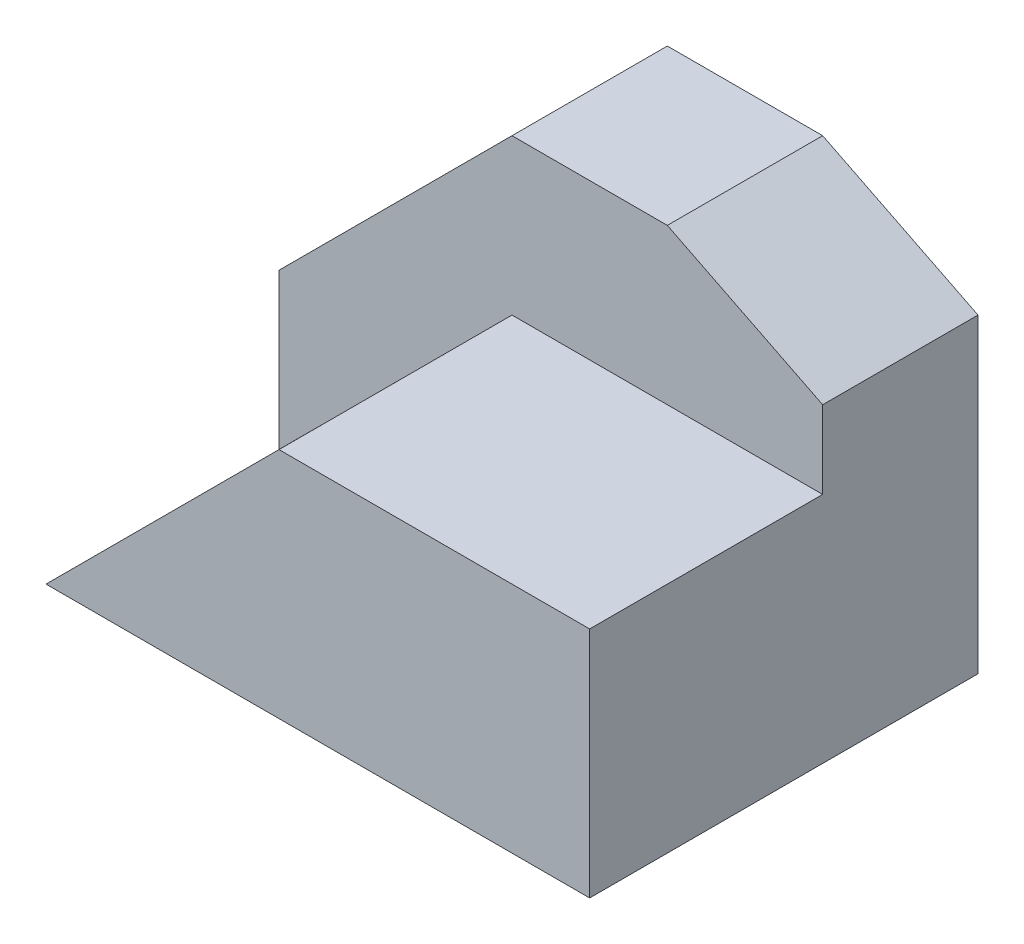
ISO-10303-21;
HEADER;
FILE_DESCRIPTION(('STEP AP214'),'2;1');
FILE_NAME('part.step','',(''),(''),'','','');
FILE_SCHEMA(('AUTOMOTIVE_DESIGN { 1 0 10303 214 1 1 1 1 }'));
ENDSEC;
DATA;
#1=APPLICATION_CONTEXT('core data for automotive mechanical design processes');
#2=APPLICATION_PROTOCOL_DEFINITION('international standard','automotive_design',2000,#1);
#3=PRODUCT_CONTEXT('',#1,'mechanical');
#4=PRODUCT('Part','Part','',(#3));
#5=PRODUCT_RELATED_PRODUCT_CATEGORY('part','',(#4));
#6=PRODUCT_DEFINITION_FORMATION('','',#4);
#7=PRODUCT_DEFINITION_CONTEXT('part definition',#1,'design');
#8=PRODUCT_DEFINITION('design','',#6,#7);
#9=PRODUCT_DEFINITION_SHAPE('','',#8);
#10=(LENGTH_UNIT() NAMED_UNIT(*) SI_UNIT(.MILLI.,.METRE.));
#11=(NAMED_UNIT(*) PLANE_ANGLE_UNIT() SI_UNIT($,.RADIAN.));
#12=(NAMED_UNIT(*) SI_UNIT($,.STERADIAN.) SOLID_ANGLE_UNIT());
#13=UNCERTAINTY_MEASURE_WITH_UNIT(LENGTH_MEASURE(1.E-05),#10,'distance_accuracy_value','');
#14=(GEOMETRIC_REPRESENTATION_CONTEXT(3) GLOBAL_UNCERTAINTY_ASSIGNED_CONTEXT((#13)) GLOBAL_UNIT_ASSIGNED_CONTEXT((#10,
#11,#12)) REPRESENTATION_CONTEXT('',''));
#15=CARTESIAN_POINT('',(0.,0.,0.));
#16=DIRECTION('',(0.,0.,1.));
#17=DIRECTION('',(1.,0.,0.));
#18=AXIS2_PLACEMENT_3D('',#15,#16,#17);
#19=CARTESIAN_POINT('',(-1.5,1.5,2.));
#20=DIRECTION('',(-0.707106781186547,0.707106781186547,0.));
#21=DIRECTION('',(-0.707106781186548,-0.707106781186548,0.));
#22=AXIS2_PLACEMENT_3D('',#19,#20,#21);
#23=PLANE('',#22);
#24=DIRECTION('',(0.707106781186548,0.707106781186548,0.));
#25=VECTOR('',#24,1.);
#26=CARTESIAN_POINT('',(-1.5,1.5,0.));
#27=LINE('',#26,#25);
#28=CARTESIAN_POINT('',(-3.5,-0.500000000000001,0.));
#29=VERTEX_POINT('',#28);
#30=CARTESIAN_POINT('',(-0.5,2.5,0.));
#31=VERTEX_POINT('',#30);
#32=EDGE_CURVE('E153',#29,#31,#27,.T.);
#33=ORIENTED_EDGE('',*,*,#32,.F.);
#34=DIRECTION('',(0.,0.,-1.));
#35=VECTOR('',#34,1.);
#36=CARTESIAN_POINT('',(-3.5,-0.500000000000001,2.));
#37=LINE('',#36,#35);
#38=CARTESIAN_POINT('',(-3.5,-0.500000000000001,2.));
#39=VERTEX_POINT('',#38);
#40=EDGE_CURVE('E11',#39,#29,#37,.T.);
#41=ORIENTED_EDGE('',*,*,#40,.F.);
#42=DIRECTION('',(0.707106781186548,0.707106781186548,0.));
#43=VECTOR('',#42,1.);
#44=CARTESIAN_POINT('',(-1.5,1.5,2.));
#45=LINE('',#44,#43);
#46=CARTESIAN_POINT('',(-0.5,2.5,2.));
#47=VERTEX_POINT('',#46);
#48=EDGE_CURVE('E169',#39,#47,#45,.T.);
#49=ORIENTED_EDGE('',*,*,#48,.T.);
#50=DIRECTION('',(0.,0.,-1.));
#51=VECTOR('',#50,1.);
#52=CARTESIAN_POINT('',(-0.5,2.5,2.));
#53=LINE('',#52,#51);
#54=EDGE_CURVE('E290',#47,#31,#53,.T.);
#55=ORIENTED_EDGE('',*,*,#54,.T.);
#56=EDGE_LOOP('',(#33,#41,#49,#55));
#57=FACE_BOUND('',#56,.T.);
#58=ADVANCED_FACE('F34',(#57),#23,.T.);
#59=CARTESIAN_POINT('',(-3.5,0.,2.));
#60=DIRECTION('',(-1.,0.,0.));
#61=DIRECTION('',(0.,0.,1.));
#62=AXIS2_PLACEMENT_3D('',#59,#60,#61);
#63=PLANE('',#62);
#64=DIRECTION('',(0.,1.,0.));
#65=VECTOR('',#64,1.);
#66=CARTESIAN_POINT('',(-3.5,0.,0.));
#67=LINE('',#66,#65);
#68=CARTESIAN_POINT('',(-3.5,-2.5,0.));
#69=VERTEX_POINT('',#68);
#70=EDGE_CURVE('E293',#69,#29,#67,.T.);
#71=ORIENTED_EDGE('',*,*,#70,.F.);
#72=DIRECTION('',(0.,0.,-1.));
#73=VECTOR('',#72,1.);
#74=CARTESIAN_POINT('',(-3.5,-2.5,2.));
#75=LINE('',#74,#73);
#76=CARTESIAN_POINT('',(-3.49995989733603,-2.50006015399596,1.99997994866801));
#77=VERTEX_POINT('',#76);
#78=EDGE_CURVE('E44',#77,#69,#75,.T.);
#79=ORIENTED_EDGE('',*,*,#78,.F.);
#80=DIRECTION('',(0.,1.,0.));
#81=VECTOR('',#80,1.);
#82=CARTESIAN_POINT('',(-3.5,0.,2.));
#83=LINE('',#82,#81);
#84=EDGE_CURVE('E165',#77,#39,#83,.T.);
#85=ORIENTED_EDGE('',*,*,#84,.T.);
#86=ORIENTED_EDGE('',*,*,#40,.T.);
#87=EDGE_LOOP('',(#71,#79,#85,#86));
#88=FACE_BOUND('',#87,.T.);
#89=ADVANCED_FACE('F207',(#88),#63,.T.);
#90=CARTESIAN_POINT('',(0.,-2.5,2.));
#91=DIRECTION('',(0.,1.,0.));
#92=DIRECTION('',(0.,0.,1.));
#93=AXIS2_PLACEMENT_3D('',#90,#91,#92);
#94=PLANE('',#93);
#95=DIRECTION('',(1.,0.,0.));
#96=VECTOR('',#95,1.);
#97=CARTESIAN_POINT('',(0.,-2.5,0.));
#98=LINE('',#97,#96);
#99=CARTESIAN_POINT('',(3.5,-2.5,0.));
#100=VERTEX_POINT('',#99);
#101=EDGE_CURVE('E296',#69,#100,#98,.T.);
#102=ORIENTED_EDGE('',*,*,#101,.T.);
#103=DIRECTION('',(0.,0.,-1.));
#104=VECTOR('',#103,1.);
#105=CARTESIAN_POINT('',(3.5,-2.5,2.));
#106=LINE('',#105,#104);
#107=CARTESIAN_POINT('',(3.5,-2.5,5.));
#108=VERTEX_POINT('',#107);
#109=EDGE_CURVE('E162',#108,#100,#106,.T.);
#110=ORIENTED_EDGE('',*,*,#109,.F.);
#111=DIRECTION('',(1.,0.,0.));
#112=VECTOR('',#111,1.);
#113=CARTESIAN_POINT('',(3.5,-2.5,5.));
#114=LINE('',#113,#112);
#115=CARTESIAN_POINT('',(-3.49998791664692,-2.49998791664692,5.));
#116=VERTEX_POINT('',#115);
#117=EDGE_CURVE('E138',#116,#108,#114,.T.);
#118=ORIENTED_EDGE('',*,*,#117,.F.);
#119=CARTESIAN_POINT('',(-3.5,-2.5,2.08810896009386));
#120=CARTESIAN_POINT('',(-3.50007851444074,-2.49988222833889,2.20945053676361));
#121=CARTESIAN_POINT('',(-3.50009156756741,-2.49986264864889,2.33079210595433));
#122=CARTESIAN_POINT('',(-3.50006176893456,-2.49990734659817,2.57344729401244));
#123=CARTESIAN_POINT('',(-3.50001893005005,-2.49997160492493,2.69476091288065));
#124=CARTESIAN_POINT('',(-3.49995233096186,-2.50007150355722,2.93739268453878));
#125=CARTESIAN_POINT('',(-3.49992857147004,-2.50010714279494,3.05871083732899));
#126=CARTESIAN_POINT('',(-3.49991500820322,-2.50012748769517,3.3013617028276));
#127=CARTESIAN_POINT('',(-3.49992520850089,-2.50011218724867,3.42269441553721));
#128=CARTESIAN_POINT('',(-3.49996535213893,-2.5000519717916,3.66536847555977));
#129=CARTESIAN_POINT('',(-3.49999529688699,-2.50000705466951,3.78670982287152));
#130=CARTESIAN_POINT('',(-3.50004596538102,-2.49993105192848,4.02938812207761));
#131=CARTESIAN_POINT('',(-3.50006668946182,-2.49989996580727,4.15072507397154));
#132=CARTESIAN_POINT('',(-3.50007245542719,-2.49989131685921,4.39338611810022));
#133=CARTESIAN_POINT('',(-3.5000575010935,-2.49991374835975,4.51471021033489));
#134=CARTESIAN_POINT('',(-3.50002522795389,-2.49996215806915,4.7573572124985));
#135=CARTESIAN_POINT('',(-3.500007909171,-2.49998813624348,4.87868012242745));
#136=CARTESIAN_POINT('',(-3.50000606245871,-2.4999909063119,5.00000303122936));
#137=B_SPLINE_CURVE_WITH_KNOTS('',3,(#119,#120,#121,#122,#123,#124,#125,#126,#127,#128,#129,
#130,#131,#132,#133,#134,#135,#136),.UNSPECIFIED.,.F.,.F.,(4,2,2,2,2,2,2,2,4),(0.,
0.364024739493984,0.727965638781843,1.09192011652536,1.45591824365735,1.81994232498666,
2.18395318616919,2.54792546563386,2.91189420019293),.UNSPECIFIED.);
#138=CARTESIAN_POINT('',(-3.5,-2.5,2.08810896009386));
#139=VERTEX_POINT('',#138);
#140=EDGE_CURVE('E151',#116,#139,#137,.F.);
#141=ORIENTED_EDGE('',*,*,#140,.T.);
#142=CARTESIAN_POINT('',(-3.49991979467205,-2.50012030799193,1.99995989733602));
#143=CARTESIAN_POINT('',(-3.49992385034678,-2.50011422447984,2.00363308435692));
#144=CARTESIAN_POINT('',(-3.49992781097316,-2.50010828354026,2.00730627171809));
#145=CARTESIAN_POINT('',(-3.49993554646942,-2.50009668029587,2.01465255356451));
#146=CARTESIAN_POINT('',(-3.49993932134402,-2.50009101798398,2.01832564804976));
#147=CARTESIAN_POINT('',(-3.49994668979138,-2.50007996531293,2.02567174636572));
#148=CARTESIAN_POINT('',(-3.49995028336865,-2.50007457494703,2.02934475019642));
#149=CARTESIAN_POINT('',(-3.4999572936106,-2.5000640595841,2.03669066939945));
#150=CARTESIAN_POINT('',(-3.49996071027957,-2.50005893458064,2.04036358477175));
#151=CARTESIAN_POINT('',(-3.49996737104641,-2.50004894343039,2.04770932922809));
#152=CARTESIAN_POINT('',(-3.49997061514835,-2.50004407727747,2.05138215831212));
#153=CARTESIAN_POINT('',(-3.49997693506911,-2.50003459739634,2.05872773233634));
#154=CARTESIAN_POINT('',(-3.4999800108918,-2.50002998366231,2.06240047727651));
#155=CARTESIAN_POINT('',(-3.49998599849443,-2.50002100225836,2.06974588513159));
#156=CARTESIAN_POINT('',(-3.49998891027806,-2.50001663458292,2.07341854804648));
#157=CARTESIAN_POINT('',(-3.49999457397808,-2.50000813903289,2.08076379394437));
#158=CARTESIAN_POINT('',(-3.49999732589797,-2.50000401115305,2.08443637692736));
#159=CARTESIAN_POINT('',(-3.5,-2.5,2.08810896009386));
#160=B_SPLINE_CURVE_WITH_KNOTS('',3,(#142,#143,#144,#145,#146,#147,#148,#149,#150,#151,#152,
#153,#154,#155,#156,#157,#158,#159),.UNSPECIFIED.,.F.,.F.,(4,2,2,2,2,2,2,2,4),(0.,
0.0110195828876986,0.0220388852407382,0.0330579138585855,0.0440766754561857,0.0550951766643598,
0.0661134240302289,0.077131424017603,0.0881491830073929),.UNSPECIFIED.);
#161=EDGE_CURVE('E130',#139,#77,#160,.F.);
#162=ORIENTED_EDGE('',*,*,#161,.T.);
#163=ORIENTED_EDGE('',*,*,#78,.T.);
#164=EDGE_LOOP('',(#102,#110,#118,#141,#162,#163));
#165=FACE_BOUND('',#164,.T.);
#166=ADVANCED_FACE('F203',(#165),#94,.F.);
#167=CARTESIAN_POINT('',(3.5,0.,2.));
#168=DIRECTION('',(-1.,0.,0.));
#169=DIRECTION('',(0.,0.,1.));
#170=AXIS2_PLACEMENT_3D('',#167,#168,#169);
#171=PLANE('',#170);
#172=DIRECTION('',(0.,1.,0.));
#173=VECTOR('',#172,1.);
#174=CARTESIAN_POINT('',(3.5,0.,0.));
#175=LINE('',#174,#173);
#176=CARTESIAN_POINT('',(3.5,1.5,0.));
#177=VERTEX_POINT('',#176);
#178=EDGE_CURVE('E298',#100,#177,#175,.T.);
#179=ORIENTED_EDGE('',*,*,#178,.T.);
#180=DIRECTION('',(0.,0.,-1.));
#181=VECTOR('',#180,1.);
#182=CARTESIAN_POINT('',(3.5,1.5,2.));
#183=LINE('',#182,#181);
#184=CARTESIAN_POINT('',(3.5,1.5,2.));
#185=VERTEX_POINT('',#184);
#186=EDGE_CURVE('E309',#185,#177,#183,.T.);
#187=ORIENTED_EDGE('',*,*,#186,.F.);
#188=DIRECTION('',(0.,1.,0.));
#189=VECTOR('',#188,1.);
#190=CARTESIAN_POINT('',(3.5,0.,2.));
#191=LINE('',#190,#189);
#192=CARTESIAN_POINT('',(3.5,0.5,2.));
#193=VERTEX_POINT('',#192);
#194=EDGE_CURVE('E168',#193,#185,#191,.T.);
#195=ORIENTED_EDGE('',*,*,#194,.F.);
#196=DIRECTION('',(0.,0.,-1.));
#197=VECTOR('',#196,1.);
#198=CARTESIAN_POINT('',(3.5,0.5,5.));
#199=LINE('',#198,#197);
#200=CARTESIAN_POINT('',(3.5,0.5,5.));
#201=VERTEX_POINT('',#200);
#202=EDGE_CURVE('E147',#201,#193,#199,.T.);
#203=ORIENTED_EDGE('',*,*,#202,.F.);
#204=DIRECTION('',(0.,1.,0.));
#205=VECTOR('',#204,1.);
#206=CARTESIAN_POINT('',(3.5,0.5,5.));
#207=LINE('',#206,#205);
#208=EDGE_CURVE('E277',#108,#201,#207,.T.);
#209=ORIENTED_EDGE('',*,*,#208,.F.);
#210=ORIENTED_EDGE('',*,*,#109,.T.);
#211=EDGE_LOOP('',(#179,#187,#195,#203,#209,#210));
#212=FACE_BOUND('',#211,.T.);
#213=ADVANCED_FACE('F199',(#212),#171,.F.);
#214=CARTESIAN_POINT('',(1.3,2.6,2.));
#215=DIRECTION('',(0.447213595499958,0.894427190999916,0.));
#216=DIRECTION('',(-0.894427190999916,0.447213595499958,0.));
#217=AXIS2_PLACEMENT_3D('',#214,#215,#216);
#218=PLANE('',#217);
#219=DIRECTION('',(0.894427190999916,-0.447213595499958,0.));
#220=VECTOR('',#219,1.);
#221=CARTESIAN_POINT('',(1.3,2.6,0.));
#222=LINE('',#221,#220);
#223=CARTESIAN_POINT('',(1.5,2.5,0.));
#224=VERTEX_POINT('',#223);
#225=EDGE_CURVE('E301',#224,#177,#222,.T.);
#226=ORIENTED_EDGE('',*,*,#225,.F.);
#227=DIRECTION('',(0.,0.,-1.));
#228=VECTOR('',#227,1.);
#229=CARTESIAN_POINT('',(1.5,2.5,2.));
#230=LINE('',#229,#228);
#231=CARTESIAN_POINT('',(1.5,2.5,2.));
#232=VERTEX_POINT('',#231);
#233=EDGE_CURVE('E307',#232,#224,#230,.T.);
#234=ORIENTED_EDGE('',*,*,#233,.F.);
#235=DIRECTION('',(0.894427190999916,-0.447213595499958,0.));
#236=VECTOR('',#235,1.);
#237=CARTESIAN_POINT('',(1.3,2.6,2.));
#238=LINE('',#237,#236);
#239=EDGE_CURVE('E284',#232,#185,#238,.T.);
#240=ORIENTED_EDGE('',*,*,#239,.T.);
#241=ORIENTED_EDGE('',*,*,#186,.T.);
#242=EDGE_LOOP('',(#226,#234,#240,#241));
#243=FACE_BOUND('',#242,.T.);
#244=ADVANCED_FACE('F195',(#243),#218,.T.);
#245=CARTESIAN_POINT('',(0.,2.5,2.));
#246=DIRECTION('',(0.,1.,0.));
#247=DIRECTION('',(0.,0.,1.));
#248=AXIS2_PLACEMENT_3D('',#245,#246,#247);
#249=PLANE('',#248);
#250=DIRECTION('',(1.,0.,0.));
#251=VECTOR('',#250,1.);
#252=CARTESIAN_POINT('',(0.,2.5,0.));
#253=LINE('',#252,#251);
#254=EDGE_CURVE('E282',#31,#224,#253,.T.);
#255=ORIENTED_EDGE('',*,*,#254,.F.);
#256=ORIENTED_EDGE('',*,*,#54,.F.);
#257=DIRECTION('',(1.,0.,0.));
#258=VECTOR('',#257,1.);
#259=CARTESIAN_POINT('',(0.,2.5,2.));
#260=LINE('',#259,#258);
#261=EDGE_CURVE('E287',#47,#232,#260,.T.);
#262=ORIENTED_EDGE('',*,*,#261,.T.);
#263=ORIENTED_EDGE('',*,*,#233,.T.);
#264=EDGE_LOOP('',(#255,#256,#262,#263));
#265=FACE_BOUND('',#264,.T.);
#266=ADVANCED_FACE('F187',(#265),#249,.T.);
#267=CARTESIAN_POINT('',(0.,0.,2.));
#268=DIRECTION('',(0.,0.,1.));
#269=DIRECTION('',(1.,0.,0.));
#270=AXIS2_PLACEMENT_3D('',#267,#268,#269);
#271=PLANE('',#270);
#272=ORIENTED_EDGE('',*,*,#261,.F.);
#273=ORIENTED_EDGE('',*,*,#48,.F.);
#274=ORIENTED_EDGE('',*,*,#84,.F.);
#275=CARTESIAN_POINT('',(-1.71923624842268,-0.719112831744547,2.00002468333563));
#276=CARTESIAN_POINT('',(-1.79339949383138,-0.793356733167273,2.00000855213282));
#277=CARTESIAN_POINT('',(-1.86759422887598,-0.867569144450407,2.00000501688511));
#278=CARTESIAN_POINT('',(-2.01600386222493,-1.0159637223419,2.0000080279766));
#279=CARTESIAN_POINT('',(-2.09021875881682,-1.09014589066261,2.00001457363084));
#280=CARTESIAN_POINT('',(-2.23863781816584,-1.23852462708184,2.0000226382168));
#281=CARTESIAN_POINT('',(-2.31284198061297,-1.31272119549049,2.0000241570245));
#282=CARTESIAN_POINT('',(-2.46122456472068,-1.4611483389662,2.0000152451509));
#283=CARTESIAN_POINT('',(-2.53540298471455,-1.5353789156993,2.00000481380306));
#284=CARTESIAN_POINT('',(-2.68376652010287,-1.68383078766935,1.99998714648671));
#285=CARTESIAN_POINT('',(-2.75795163535756,-1.7580520830459,1.99997991046234));
#286=CARTESIAN_POINT('',(-2.90635243615903,-1.90645163736755,1.9999801597583));
#287=CARTESIAN_POINT('',(-2.9805681186161,-1.98062989940285,1.99998764384265));
#288=CARTESIAN_POINT('',(-3.12902890052343,-2.12895234395007,2.00001531131467));
#289=CARTESIAN_POINT('',(-3.20327399897588,-2.20309652745977,2.00003549430322));
#290=CARTESIAN_POINT('',(-3.35168923801764,-2.351497351091,2.00003837738533));
#291=CARTESIAN_POINT('',(-3.42585935488759,-2.42575401491993,2.00002106799353));
#292=CARTESIAN_POINT('',(-3.49991979467205,-2.50012030799192,1.99995989733603));
#293=B_SPLINE_CURVE_WITH_KNOTS('',3,(#275,#276,#277,#278,#279,#280,#281,#282,#283,#284,#285,
#286,#287,#288,#289,#290,#291,#292),.UNSPECIFIED.,.F.,.F.,(4,2,2,2,2,2,2,2,4),(0.,
0.314819106719181,0.629616823586347,0.944422307076123,1.2592453505075,1.57406288872731,
1.88885399430655,2.20363520675404,2.51849606629432),.UNSPECIFIED.);
#294=CARTESIAN_POINT('',(-1.71920538486048,-0.719143676521414,2.00001234166781));
#295=VERTEX_POINT('',#294);
#296=EDGE_CURVE('E136',#295,#77,#293,.T.);
#297=ORIENTED_EDGE('',*,*,#296,.F.);
#298=CARTESIAN_POINT('',(-0.499951631016068,0.499927446524101,1.99997581550804));
#299=CARTESIAN_POINT('',(-0.550788881683792,0.449177595763746,1.99999329548951));
#300=CARTESIAN_POINT('',(-0.601611714147525,0.398413298361051,2.00000500250171));
#301=CARTESIAN_POINT('',(-0.703235205318425,0.296851441441508,2.00001732935199));
#302=CARTESIAN_POINT('',(-0.754035861005819,0.246053878902882,2.00001794798174));
#303=CARTESIAN_POINT('',(-0.855615055527254,0.144427708511351,2.00000855280772));
#304=CARTESIAN_POINT('',(-0.906393592019188,0.0935990983181102,1.99999853806746));
#305=CARTESIAN_POINT('',(-1.00794991694831,-0.00805743856971661,1.99997849567572));
#306=CARTESIAN_POINT('',(-1.0587277053859,-0.0588853652637814,1.99996846802443));
#307=CARTESIAN_POINT('',(-1.16032468374408,-0.160486085617074,1.9999677196254));
#308=CARTESIAN_POINT('',(-1.21114386713968,-0.211258885800713,1.99997699626779));
#309=CARTESIAN_POINT('',(-1.31279283402923,-0.312789026771877,2.00000076145147));
#310=CARTESIAN_POINT('',(-1.363622616904,-0.363546368179871,2.00001524974483));
#311=CARTESIAN_POINT('',(-1.4652583957778,-0.465092664429661,2.00003314626963));
#312=CARTESIAN_POINT('',(-1.51606438965222,-0.51588162139846,2.00003655365075));
#313=CARTESIAN_POINT('',(-1.6176608577832,-0.617482815346641,2.00003560848732));
#314=CARTESIAN_POINT('',(-1.66845133055787,-0.668295053807914,2.00003125535));
#315=CARTESIAN_POINT('',(-1.71923624842268,-0.719112831744547,2.00002468333563));
#316=B_SPLINE_CURVE_WITH_KNOTS('',3,(#298,#299,#300,#301,#302,#303,#304,#305,#306,#307,#308,
#309,#310,#311,#312,#313,#314,#315),.UNSPECIFIED.,.F.,.F.,(4,2,2,2,2,2,2,2,4),(0.,
0.215498870763307,0.431021224479397,0.646562560981058,0.862100843190829,1.07760998717084,
1.29310888018153,1.50862430966037,1.7241562010612),.UNSPECIFIED.);
#317=CARTESIAN_POINT('',(-0.499927419177947,0.5,2.));
#318=VERTEX_POINT('',#317);
#319=EDGE_CURVE('E52',#318,#295,#316,.T.);
#320=ORIENTED_EDGE('',*,*,#319,.F.);
#321=DIRECTION('',(-1.,0.,0.));
#322=VECTOR('',#321,1.);
#323=CARTESIAN_POINT('',(-0.500000000000001,0.5,2.));
#324=LINE('',#323,#322);
#325=EDGE_CURVE('E60',#193,#318,#324,.T.);
#326=ORIENTED_EDGE('',*,*,#325,.F.);
#327=ORIENTED_EDGE('',*,*,#194,.T.);
#328=ORIENTED_EDGE('',*,*,#239,.F.);
#329=EDGE_LOOP('',(#272,#273,#274,#297,#320,#326,#327,#328));
#330=FACE_BOUND('',#329,.T.);
#331=ADVANCED_FACE('F134',(#330),#271,.T.);
#332=CARTESIAN_POINT('',(0.,0.,0.));
#333=DIRECTION('',(0.,0.,1.));
#334=DIRECTION('',(1.,0.,0.));
#335=AXIS2_PLACEMENT_3D('',#332,#333,#334);
#336=PLANE('',#335);
#337=ORIENTED_EDGE('',*,*,#32,.T.);
#338=ORIENTED_EDGE('',*,*,#254,.T.);
#339=ORIENTED_EDGE('',*,*,#225,.T.);
#340=ORIENTED_EDGE('',*,*,#178,.F.);
#341=ORIENTED_EDGE('',*,*,#101,.F.);
#342=ORIENTED_EDGE('',*,*,#70,.T.);
#343=EDGE_LOOP('',(#337,#338,#339,#340,#341,#342));
#344=FACE_BOUND('',#343,.T.);
#345=ADVANCED_FACE('F186',(#344),#336,.F.);
#346=CARTESIAN_POINT('',(-0.500000000000001,0.5,5.));
#347=DIRECTION('',(0.,-1.,0.));
#348=DIRECTION('',(0.,0.,-1.));
#349=AXIS2_PLACEMENT_3D('',#346,#347,#348);
#350=PLANE('',#349);
#351=ORIENTED_EDGE('',*,*,#325,.T.);
#352=DIRECTION('',(0.,0.,-1.));
#353=VECTOR('',#352,1.);
#354=CARTESIAN_POINT('',(-0.500000000000001,0.5,5.));
#355=LINE('',#354,#353);
#356=CARTESIAN_POINT('',(-0.500000000000001,0.5,5.));
#357=VERTEX_POINT('',#356);
#358=EDGE_CURVE('E145',#357,#318,#355,.T.);
#359=ORIENTED_EDGE('',*,*,#358,.F.);
#360=DIRECTION('',(-1.,0.,0.));
#361=VECTOR('',#360,1.);
#362=CARTESIAN_POINT('',(-0.500000000000001,0.5,5.));
#363=LINE('',#362,#361);
#364=EDGE_CURVE('E279',#201,#357,#363,.T.);
#365=ORIENTED_EDGE('',*,*,#364,.F.);
#366=ORIENTED_EDGE('',*,*,#202,.T.);
#367=EDGE_LOOP('',(#351,#359,#365,#366));
#368=FACE_BOUND('',#367,.T.);
#369=ADVANCED_FACE('F143',(#368),#350,.F.);
#370=CARTESIAN_POINT('',(-3.5,-2.5,5.));
#371=DIRECTION('',(0.707106781186548,-0.707106781186547,0.));
#372=DIRECTION('',(0.707106781186547,0.707106781186548,0.));
#373=AXIS2_PLACEMENT_3D('',#370,#371,#372);
#374=PLANE('',#373);
#375=ORIENTED_EDGE('',*,*,#358,.T.);
#376=DIRECTION('',(-0.577350269189626,-0.577350269189626,0.577350269189626));
#377=VECTOR('',#376,1.);
#378=CARTESIAN_POINT('',(-3.5,-2.5,5.));
#379=LINE('',#378,#377);
#380=EDGE_CURVE('E115',#318,#116,#379,.T.);
#381=ORIENTED_EDGE('',*,*,#380,.T.);
#382=DIRECTION('',(-0.707106781186547,-0.707106781186548,0.));
#383=VECTOR('',#382,1.);
#384=CARTESIAN_POINT('',(-3.5,-2.5,5.));
#385=LINE('',#384,#383);
#386=EDGE_CURVE('E150',#357,#116,#385,.T.);
#387=ORIENTED_EDGE('',*,*,#386,.F.);
#388=EDGE_LOOP('',(#375,#381,#387));
#389=FACE_BOUND('',#388,.T.);
#390=ADVANCED_FACE('F149',(#389),#374,.F.);
#391=CARTESIAN_POINT('',(0.,0.,5.));
#392=DIRECTION('',(0.,0.,1.));
#393=DIRECTION('',(1.,0.,0.));
#394=AXIS2_PLACEMENT_3D('',#391,#392,#393);
#395=PLANE('',#394);
#396=ORIENTED_EDGE('',*,*,#117,.T.);
#397=ORIENTED_EDGE('',*,*,#208,.T.);
#398=ORIENTED_EDGE('',*,*,#364,.T.);
#399=ORIENTED_EDGE('',*,*,#386,.T.);
#400=EDGE_LOOP('',(#396,#397,#398,#399));
#401=FACE_BOUND('',#400,.T.);
#402=ADVANCED_FACE('F246',(#401),#395,.T.);
#403=CARTESIAN_POINT('',(-3.5,-2.5,5.));
#404=DIRECTION('',(0.,0.707106781186548,0.707106781186548));
#405=DIRECTION('',(0.,-0.707106781186548,0.707106781186548));
#406=AXIS2_PLACEMENT_3D('',#403,#404,#405);
#407=PLANE('',#406);
#408=CARTESIAN_POINT('',(-0.500473553876584,-0.999289669185128,3.50023677693829));
#409=CARTESIAN_POINT('',(-0.499717812426579,-0.93770787072613,3.43714349557929));
#410=CARTESIAN_POINT('',(-0.499493699293111,-0.875593375061089,3.37458077364731));
#411=CARTESIAN_POINT('',(-0.49951447688696,-0.750660557767157,3.24968951154108));
#412=CARTESIAN_POINT('',(-0.499761129913082,-0.687840470082536,3.1873627299087));
#413=CARTESIAN_POINT('',(-0.50012586601354,-0.562348050365606,3.06259978239269));
#414=CARTESIAN_POINT('',(-0.500243988190959,-0.499675679186519,3.00016365556844));
#415=CARTESIAN_POINT('',(-0.500294829791438,-0.37459098749546,2.87518064707834));
#416=CARTESIAN_POINT('',(-0.500227771064954,-0.312178445445359,2.81263398757527));
#417=CARTESIAN_POINT('',(-0.500065444083916,-0.187397930948906,2.68752881911674));
#418=CARTESIAN_POINT('',(-0.499970183143024,-0.125029951144468,2.62497031743052));
#419=CARTESIAN_POINT('',(-0.499882532761758,-0.000154495807254274,2.49991956133077));
#420=CARTESIAN_POINT('',(-0.499890203410755,0.0623530399070581,2.43742736691445));
#421=CARTESIAN_POINT('',(-0.499960470662573,0.187443748899713,2.31247719242544));
#422=CARTESIAN_POINT('',(-0.500023085529486,0.250026940418224,2.25001923064075));
#423=CARTESIAN_POINT('',(-0.500074640937632,0.375082852585208,2.12506642929006));
#424=CARTESIAN_POINT('',(-0.500063624827381,0.43755561657764,2.06257163307712));
#425=CARTESIAN_POINT('',(-0.499951631016068,0.499927446524101,1.99997581550804));
#426=B_SPLINE_CURVE_WITH_KNOTS('',3,(#408,#409,#410,#411,#412,#413,#414,#415,#416,#417,#418,
#419,#420,#421,#422,#423,#424,#425),.UNSPECIFIED.,.F.,.F.,(4,2,2,2,2,2,2,2,4),(0.,
0.264484843976318,0.529961721182602,0.795357809461403,1.06043608585679,1.32544567979608,
1.5906099876776,1.85586247263733,2.12095881015801),.UNSPECIFIED.);
#427=CARTESIAN_POINT('',(-0.500236777089284,-0.999644834672262,3.50011838854464));
#428=VERTEX_POINT('',#427);
#429=EDGE_CURVE('E117',#428,#318,#426,.T.);
#430=ORIENTED_EDGE('',*,*,#429,.F.);
#431=CARTESIAN_POINT('',(-3.50000606245871,-2.4999909063119,5.00000303122936));
#432=CARTESIAN_POINT('',(-3.37494787671064,-2.43760881011812,4.93747393835532));
#433=CARTESIAN_POINT('',(-3.24992839454586,-2.37512994548017,4.87496419727293));
#434=CARTESIAN_POINT('',(-2.99993276337052,-2.25010721593712,4.74996638168526));
#435=CARTESIAN_POINT('',(-2.87495661102159,-2.18756335937949,4.68747830551079));
#436=CARTESIAN_POINT('',(-2.62498114274499,-2.06252293719561,4.56249057137249));
#437=CARTESIAN_POINT('',(-2.49998182626197,-2.00002637295745,4.49999091313099));
#438=CARTESIAN_POINT('',(-2.24999216031121,-1.87501626783517,4.37499608015561));
#439=CARTESIAN_POINT('',(-2.12500181073984,-1.81250272720994,4.31250090536992));
#440=CARTESIAN_POINT('',(-1.8750287979451,-1.68744126808932,4.18751439897255));
#441=CARTESIAN_POINT('',(-1.75004613523576,-1.62489334830795,4.12502306761788));
#442=CARTESIAN_POINT('',(-1.56247506344679,-1.53128997157089,4.03123753172339));
#443=CARTESIAN_POINT('',(-1.49993114772492,-1.50012325582941,3.99996557386246));
#444=CARTESIAN_POINT('',(-1.37494083622673,-1.43761399757286,3.93747041811336));
#445=CARTESIAN_POINT('',(-1.31249441335656,-1.40627152274433,3.90624720667828));
#446=CARTESIAN_POINT('',(-1.18760205038294,-1.34358106301126,3.84380102519147));
#447=CARTESIAN_POINT('',(-1.12515611031958,-1.31223307800165,3.81257805515979));
#448=CARTESIAN_POINT('',(-1.00012440162147,-1.24976380654368,3.75006220081074));
#449=CARTESIAN_POINT('',(-0.937538567960571,-1.21864268309518,3.71876928398029));
#450=CARTESIAN_POINT('',(-0.812251707471043,-1.15663996289698,3.65612585373552));
#451=CARTESIAN_POINT('',(-0.749550655284101,-1.12575842941504,3.62477532764205));
#452=CARTESIAN_POINT('',(-0.624606521642481,-1.0633071957922,3.56230326082124));
#453=CARTESIAN_POINT('',(-0.562362700733435,-1.03173933306016,3.53118135036672));
#454=CARTESIAN_POINT('',(-0.500473554480551,-0.99928966950392,3.50023677724028));
#455=B_SPLINE_CURVE_WITH_KNOTS('',3,(#431,#432,#433,#434,#435,#436,#437,#438,#439,#440,#441,
#442,#443,#444,#445,#446,#447,#448,#449,#450,#451,#452,#453,#454),.UNSPECIFIED.,.F.,.F.,(4,2,2,
2,2,2,2,2,2,2,2,4),(0.,0.459313116782449,0.918573145455281,1.3778461683142,1.83711254136508,
2.29639745532706,2.52606960277629,2.75565866325975,2.98525271994332,3.21499807198269,
3.44480215731756,3.67405253446358),.UNSPECIFIED.);
#456=EDGE_CURVE('E120',#116,#428,#455,.T.);
#457=ORIENTED_EDGE('',*,*,#456,.F.);
#458=ORIENTED_EDGE('',*,*,#380,.F.);
#459=EDGE_LOOP('',(#430,#457,#458));
#460=FACE_BOUND('',#459,.T.);
#461=ADVANCED_FACE('F116',(#460),#407,.F.);
#462=CARTESIAN_POINT('',(-3.53760829963284,-2.51858658836285,5.03381468763642));
#463=CARTESIAN_POINT('',(-3.56314173969844,-2.53720567757136,4.42320540926055));
#464=CARTESIAN_POINT('',(-3.5848007762554,-2.56163637204244,3.81065892913057));
#465=CARTESIAN_POINT('',(-3.59926450210296,-2.59686003257812,3.19451479364554));
#466=CARTESIAN_POINT('',(-3.62031414044337,-2.62220482437414,2.58166361440725));
#467=CARTESIAN_POINT('',(-3.6433062799521,-2.64463586441794,1.96978368575297));
#468=CARTESIAN_POINT('',(-3.15245207962776,-2.32667457964238,4.9950596802081));
#469=CARTESIAN_POINT('',(-3.2081853112723,-2.2999939814825,4.39955029762173));
#470=CARTESIAN_POINT('',(-3.25445178516275,-2.28751351995393,3.79930753615832));
#471=CARTESIAN_POINT('',(-3.29028822703424,-2.29067810645312,3.19384975868555));
#472=CARTESIAN_POINT('',(-3.31509948102518,-2.31038047477357,2.58287938727234));
#473=CARTESIAN_POINT('',(-3.33687937105256,-2.33462988903922,1.97039333387744));
#474=CARTESIAN_POINT('',(-2.74994025534139,-2.16079597734393,4.94762687063907));
#475=CARTESIAN_POINT('',(-2.83671130898508,-2.08755864618533,4.36763639905235));
#476=CARTESIAN_POINT('',(-2.9155398784455,-2.02623504130152,3.78367468537391));
#477=CARTESIAN_POINT('',(-2.97146816524601,-1.99926186040756,3.18826283036564));
#478=CARTESIAN_POINT('',(-3.01297702604384,-1.99391781851782,2.58564126235588));
#479=CARTESIAN_POINT('',(-3.02701204836875,-2.02978453433651,1.96928277510969));
#480=CARTESIAN_POINT('',(-2.32711631336951,-2.02538555157306,4.89003800222741));
#481=CARTESIAN_POINT('',(-2.45328036156515,-1.89305872858725,4.3297440279165));
#482=CARTESIAN_POINT('',(-2.56032817522785,-1.78940625739962,3.75989193633945));
#483=CARTESIAN_POINT('',(-2.65747977051601,-1.70059811377482,3.18509173557471));
#484=CARTESIAN_POINT('',(-2.7050014417073,-1.68623485629404,2.58547657276185));
#485=CARTESIAN_POINT('',(-2.72003619100263,-1.720601981658,1.96961794900089));
#486=CARTESIAN_POINT('',(-1.59778751517102,-1.88151503022016,4.77277559568693));
#487=CARTESIAN_POINT('',(-1.79187924668158,-1.64729668226083,4.2464454630337));
#488=CARTESIAN_POINT('',(-1.9825603689972,-1.41819424809539,3.71841002578264));
#489=CARTESIAN_POINT('',(-2.131817934603,-1.25122714899251,3.16966281017729));
#490=CARTESIAN_POINT('',(-2.21540223039308,-1.18276995461499,2.58807895966353));
#491=CARTESIAN_POINT('',(-2.22456095371566,-1.22595111893715,1.96928232291619));
#492=CARTESIAN_POINT('',(-0.786900819510173,-1.85998135506072,4.61473424041534));
#493=CARTESIAN_POINT('',(-1.05251514592811,-1.51847911474086,4.12416540521562));
#494=CARTESIAN_POINT('',(-1.31916311110554,-1.17542641628021,3.63411338939593));
#495=CARTESIAN_POINT('',(-1.58837784617271,-0.828523562988309,3.14534475852077));
#496=CARTESIAN_POINT('',(-1.69452979015012,-0.72621489632807,2.57504473210092));
#497=CARTESIAN_POINT('',(-1.73067523335277,-0.728915980830723,1.96974145529358));
#498=CARTESIAN_POINT('',(-0.468134208470158,-1.86991389169811,4.54892982487994));
#499=CARTESIAN_POINT('',(-0.753521873931891,-1.49875164281221,4.06824765920226));
#500=CARTESIAN_POINT('',(-1.08299445590016,-1.06146201916555,3.60960795177748));
#501=CARTESIAN_POINT('',(-1.35548668701635,-0.709642921799891,3.12247806892753));
#502=CARTESIAN_POINT('',(-1.49747438306285,-0.55358062703617,2.57009591854177));
#503=CARTESIAN_POINT('',(-1.5442396304091,-0.540352005323325,1.97010254380636));
#504=CARTESIAN_POINT('',(0.09550761198534,-1.89812334043461,4.43044683895882));
#505=CARTESIAN_POINT('',(-0.229616075168598,-1.4673570590106,3.96963268412696));
#506=CARTESIAN_POINT('',(-0.55625355743227,-1.03432008492068,3.50957542685066));
#507=CARTESIAN_POINT('',(-0.978707462113387,-0.457558477206768,3.09742638078212));
#508=CARTESIAN_POINT('',(-1.12191679286357,-0.299663730388423,2.54565504774886));
#509=CARTESIAN_POINT('',(-1.21935401301088,-0.210427149473875,1.97099765941383));
#510=CARTESIAN_POINT('',(0.651796041078257,-1.91530270212734,4.31564054871895));
#511=CARTESIAN_POINT('',(0.301233300229128,-1.44637784016029,3.8675459207349));
#512=CARTESIAN_POINT('',(-0.0945613499238096,-0.909605114237181,3.44206724740247));
#513=CARTESIAN_POINT('',(-0.501919363087028,-0.355487343799089,3.02237025557595));
#514=CARTESIAN_POINT('',(-0.742722989793133,-0.051201153047105,2.51939607052006));
#515=CARTESIAN_POINT('',(-0.895549853238088,0.121119892813741,1.97243350383403));
#516=CARTESIAN_POINT('',(0.885417001897732,-1.91669824133263,4.26858910263121));
#517=CARTESIAN_POINT('',(0.516712198727104,-1.42056028588337,3.82956550580778));
#518=CARTESIAN_POINT('',(0.114254752562527,-0.873793365942729,3.40741823048148));
#519=CARTESIAN_POINT('',(-0.299129172636364,-0.310636727451134,2.99073419467235));
#520=CARTESIAN_POINT('',(-0.581557896957125,0.0560871097229612,2.50857255842414));
#521=CARTESIAN_POINT('',(-0.757218039585976,0.262658074359538,1.97302663132993));
#522=CARTESIAN_POINT('',(1.11543249544952,-1.91268557963642,4.22334039017729));
#523=CARTESIAN_POINT('',(0.733530682821078,-1.3967521100004,3.79091529808279));
#524=CARTESIAN_POINT('',(0.321666389399904,-0.83587491917493,3.37347144638468));
#525=CARTESIAN_POINT('',(-0.107156606021205,-0.249559675349853,2.96450694568679));
#526=CARTESIAN_POINT('',(-0.417119351755442,0.158465193944436,2.49611232014525));
#527=CARTESIAN_POINT('',(-0.618842197685878,0.404130213533381,1.97359774470186));
#528=CARTESIAN_POINT('',(1.34287267428576,-1.90480994586688,4.17937933508114));
#529=CARTESIAN_POINT('',(0.947737440725994,-1.36902634483386,3.7535709534523));
#530=CARTESIAN_POINT('',(0.526956645754335,-0.794774401682677,3.34058535252942));
#531=CARTESIAN_POINT('',(0.0836271333972254,-0.186699382453531,2.93887411029954));
#532=CARTESIAN_POINT('',(-0.253118090223826,0.261499203671024,2.48387072370141));
#533=CARTESIAN_POINT('',(-0.480462185554036,0.545596097359563,1.97416677295791));
#534=B_SPLINE_SURFACE_WITH_KNOTS('',5,5,((#462,#463,#464,#465,#466,#467),(#468,#469,#470,#471,
#472,#473),(#474,#475,#476,#477,#478,#479),(#480,#481,#482,#483,#484,#485),(#486,#487,#488,#489,
#490,#491),(#492,#493,#494,#495,#496,#497),(#498,#499,#500,#501,#502,#503),(#504,#505,#506,#507,
#508,#509),(#510,#511,#512,#513,#514,#515),(#516,#517,#518,#519,#520,#521),(#522,#523,#524,#525,
#526,#527),(#528,#529,#530,#531,#532,#533)),.UNSPECIFIED.,.F.,.F.,.F.,(6,3,3,6),(6,6),
(-2.01099335293038,0.126696161162878,1.42716799220063,2.39661376261999),(-1.76044781196187,
1.1840008696409),.UNSPECIFIED.);
#535=ORIENTED_EDGE('',*,*,#161,.F.);
#536=ORIENTED_EDGE('',*,*,#140,.F.);
#537=ORIENTED_EDGE('',*,*,#456,.T.);
#538=ORIENTED_EDGE('',*,*,#429,.T.);
#539=ORIENTED_EDGE('',*,*,#319,.T.);
#540=ORIENTED_EDGE('',*,*,#296,.T.);
#541=EDGE_LOOP('',(#535,#536,#537,#538,#539,#540));
#542=FACE_BOUND('',#541,.T.);
#543=ADVANCED_FACE('F128',(#542),#534,.T.);
#544=CLOSED_SHELL('',(#58,#89,#166,#213,#244,#266,#331,#345,#369,#390,#402,#461,#543));
#545=MANIFOLD_SOLID_BREP('B2',#544);
#546=ADVANCED_BREP_SHAPE_REPRESENTATION('',(#18,#545),#14);
#547=SHAPE_DEFINITION_REPRESENTATION(#9,#546);
ENDSEC;
END-ISO-10303-21;
